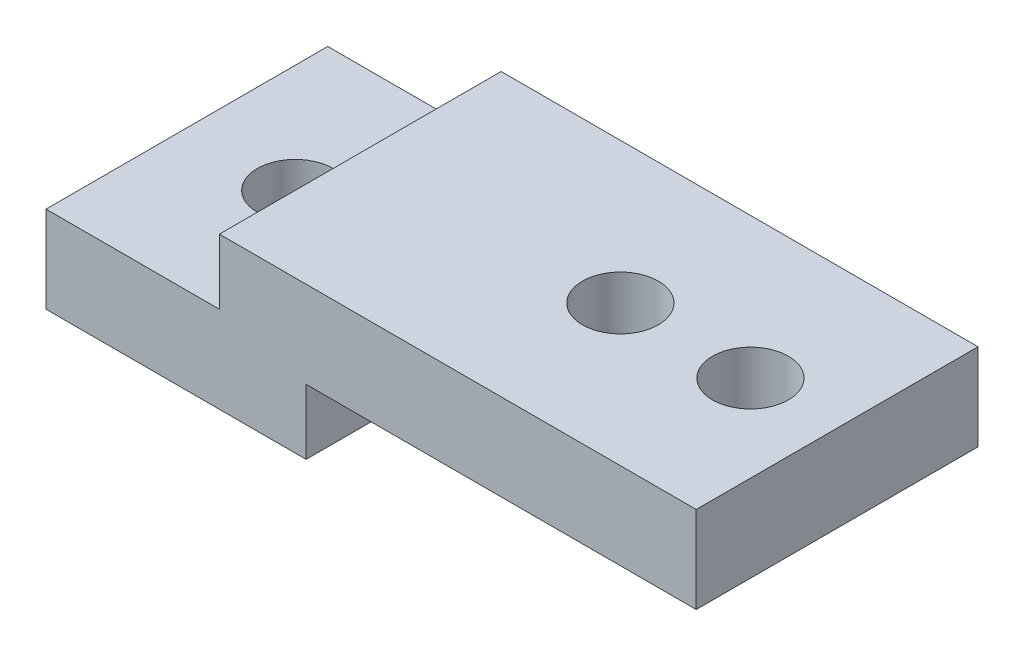
ISO-10303-21;
HEADER;
FILE_DESCRIPTION(('STEP AP214'),'2;1');
FILE_NAME('part.step','',(''),(''),'','','');
FILE_SCHEMA(('AUTOMOTIVE_DESIGN { 1 0 10303 214 1 1 1 1 }'));
ENDSEC;
DATA;
#1=APPLICATION_CONTEXT('core data for automotive mechanical design processes');
#2=APPLICATION_PROTOCOL_DEFINITION('international standard','automotive_design',2000,#1);
#3=PRODUCT_CONTEXT('',#1,'mechanical');
#4=PRODUCT('Part','Part','',(#3));
#5=PRODUCT_RELATED_PRODUCT_CATEGORY('part','',(#4));
#6=PRODUCT_DEFINITION_FORMATION('','',#4);
#7=PRODUCT_DEFINITION_CONTEXT('part definition',#1,'design');
#8=PRODUCT_DEFINITION('design','',#6,#7);
#9=PRODUCT_DEFINITION_SHAPE('','',#8);
#10=(LENGTH_UNIT() NAMED_UNIT(*) SI_UNIT(.MILLI.,.METRE.));
#11=(NAMED_UNIT(*) PLANE_ANGLE_UNIT() SI_UNIT($,.RADIAN.));
#12=(NAMED_UNIT(*) SI_UNIT($,.STERADIAN.) SOLID_ANGLE_UNIT());
#13=UNCERTAINTY_MEASURE_WITH_UNIT(LENGTH_MEASURE(1.E-05),#10,'distance_accuracy_value','');
#14=(GEOMETRIC_REPRESENTATION_CONTEXT(3) GLOBAL_UNCERTAINTY_ASSIGNED_CONTEXT((#13)) GLOBAL_UNIT_ASSIGNED_CONTEXT((#10,
#11,#12)) REPRESENTATION_CONTEXT('',''));
#15=CARTESIAN_POINT('',(0.,0.,0.));
#16=DIRECTION('',(0.,0.,1.));
#17=DIRECTION('',(1.,0.,0.));
#18=AXIS2_PLACEMENT_3D('',#15,#16,#17);
#19=CARTESIAN_POINT('',(0.,4.,-13.));
#20=DIRECTION('',(1.,0.,0.));
#21=DIRECTION('',(0.,0.,-1.));
#22=AXIS2_PLACEMENT_3D('',#19,#20,#21);
#23=PLANE('',#22);
#24=DIRECTION('',(0.,0.,1.));
#25=VECTOR('',#24,1.);
#26=CARTESIAN_POINT('',(0.,0.,-13.));
#27=LINE('',#26,#25);
#28=CARTESIAN_POINT('',(0.,0.,-13.));
#29=VERTEX_POINT('',#28);
#30=CARTESIAN_POINT('',(0.,0.,0.));
#31=VERTEX_POINT('',#30);
#32=EDGE_CURVE('E146',#29,#31,#27,.T.);
#33=ORIENTED_EDGE('',*,*,#32,.T.);
#34=DIRECTION('',(0.,-1.,0.));
#35=VECTOR('',#34,1.);
#36=CARTESIAN_POINT('',(0.,4.,0.));
#37=LINE('',#36,#35);
#38=CARTESIAN_POINT('',(0.,4.,0.));
#39=VERTEX_POINT('',#38);
#40=EDGE_CURVE('E11',#39,#31,#37,.T.);
#41=ORIENTED_EDGE('',*,*,#40,.F.);
#42=DIRECTION('',(0.,0.,1.));
#43=VECTOR('',#42,1.);
#44=CARTESIAN_POINT('',(0.,4.,-13.));
#45=LINE('',#44,#43);
#46=CARTESIAN_POINT('',(0.,4.,-13.));
#47=VERTEX_POINT('',#46);
#48=EDGE_CURVE('E150',#47,#39,#45,.T.);
#49=ORIENTED_EDGE('',*,*,#48,.F.);
#50=DIRECTION('',(0.,-1.,0.));
#51=VECTOR('',#50,1.);
#52=CARTESIAN_POINT('',(0.,4.,-13.));
#53=LINE('',#52,#51);
#54=EDGE_CURVE('E107',#47,#29,#53,.T.);
#55=ORIENTED_EDGE('',*,*,#54,.T.);
#56=EDGE_LOOP('',(#33,#41,#49,#55));
#57=FACE_BOUND('',#56,.T.);
#58=ADVANCED_FACE('F33',(#57),#23,.F.);
#59=CARTESIAN_POINT('',(0.,4.,0.));
#60=DIRECTION('',(0.,0.,-1.));
#61=DIRECTION('',(-1.,0.,0.));
#62=AXIS2_PLACEMENT_3D('',#59,#60,#61);
#63=PLANE('',#62);
#64=DIRECTION('',(1.,0.,0.));
#65=VECTOR('',#64,1.);
#66=CARTESIAN_POINT('',(0.,0.,0.));
#67=LINE('',#66,#65);
#68=CARTESIAN_POINT('',(12.,0.,0.));
#69=VERTEX_POINT('',#68);
#70=EDGE_CURVE('E160',#31,#69,#67,.T.);
#71=ORIENTED_EDGE('',*,*,#70,.T.);
#72=DIRECTION('',(0.,-1.,0.));
#73=VECTOR('',#72,1.);
#74=CARTESIAN_POINT('',(12.,0.,0.));
#75=LINE('',#74,#73);
#76=CARTESIAN_POINT('',(12.,3.,0.));
#77=VERTEX_POINT('',#76);
#78=EDGE_CURVE('E55',#77,#69,#75,.T.);
#79=ORIENTED_EDGE('',*,*,#78,.F.);
#80=DIRECTION('',(-1.,0.,0.));
#81=VECTOR('',#80,1.);
#82=CARTESIAN_POINT('',(30.,3.,0.));
#83=LINE('',#82,#81);
#84=CARTESIAN_POINT('',(30.,3.,0.));
#85=VERTEX_POINT('',#84);
#86=EDGE_CURVE('E135',#85,#77,#83,.T.);
#87=ORIENTED_EDGE('',*,*,#86,.F.);
#88=DIRECTION('',(0.,-1.,0.));
#89=VECTOR('',#88,1.);
#90=CARTESIAN_POINT('',(30.,4.,0.));
#91=LINE('',#90,#89);
#92=CARTESIAN_POINT('',(30.,7.,0.));
#93=VERTEX_POINT('',#92);
#94=EDGE_CURVE('E40',#93,#85,#91,.T.);
#95=ORIENTED_EDGE('',*,*,#94,.F.);
#96=DIRECTION('',(1.,0.,0.));
#97=VECTOR('',#96,1.);
#98=CARTESIAN_POINT('',(30.,7.,0.));
#99=LINE('',#98,#97);
#100=CARTESIAN_POINT('',(8.,7.,0.));
#101=VERTEX_POINT('',#100);
#102=EDGE_CURVE('E121',#101,#93,#99,.T.);
#103=ORIENTED_EDGE('',*,*,#102,.F.);
#104=DIRECTION('',(0.,-1.,0.));
#105=VECTOR('',#104,1.);
#106=CARTESIAN_POINT('',(8.,7.,0.));
#107=LINE('',#106,#105);
#108=CARTESIAN_POINT('',(8.,4.,0.));
#109=VERTEX_POINT('',#108);
#110=EDGE_CURVE('E130',#101,#109,#107,.T.);
#111=ORIENTED_EDGE('',*,*,#110,.T.);
#112=DIRECTION('',(1.,0.,0.));
#113=VECTOR('',#112,1.);
#114=CARTESIAN_POINT('',(0.,4.,0.));
#115=LINE('',#114,#113);
#116=EDGE_CURVE('E153',#39,#109,#115,.T.);
#117=ORIENTED_EDGE('',*,*,#116,.F.);
#118=ORIENTED_EDGE('',*,*,#40,.T.);
#119=EDGE_LOOP('',(#71,#79,#87,#95,#103,#111,#117,#118));
#120=FACE_BOUND('',#119,.T.);
#121=ADVANCED_FACE('F167',(#120),#63,.F.);
#122=CARTESIAN_POINT('',(30.,4.,-13.));
#123=DIRECTION('',(-1.,0.,0.));
#124=DIRECTION('',(0.,0.,1.));
#125=AXIS2_PLACEMENT_3D('',#122,#123,#124);
#126=PLANE('',#125);
#127=ORIENTED_EDGE('',*,*,#94,.T.);
#128=DIRECTION('',(0.,0.,1.));
#129=VECTOR('',#128,1.);
#130=CARTESIAN_POINT('',(30.,3.,-13.));
#131=LINE('',#130,#129);
#132=CARTESIAN_POINT('',(30.,3.,-13.));
#133=VERTEX_POINT('',#132);
#134=EDGE_CURVE('E104',#133,#85,#131,.T.);
#135=ORIENTED_EDGE('',*,*,#134,.F.);
#136=DIRECTION('',(0.,-1.,0.));
#137=VECTOR('',#136,1.);
#138=CARTESIAN_POINT('',(30.,4.,-13.));
#139=LINE('',#138,#137);
#140=CARTESIAN_POINT('',(30.,7.,-13.));
#141=VERTEX_POINT('',#140);
#142=EDGE_CURVE('E98',#141,#133,#139,.T.);
#143=ORIENTED_EDGE('',*,*,#142,.F.);
#144=DIRECTION('',(0.,0.,-1.));
#145=VECTOR('',#144,1.);
#146=CARTESIAN_POINT('',(30.,7.,0.));
#147=LINE('',#146,#145);
#148=EDGE_CURVE('E103',#93,#141,#147,.T.);
#149=ORIENTED_EDGE('',*,*,#148,.F.);
#150=EDGE_LOOP('',(#127,#135,#143,#149));
#151=FACE_BOUND('',#150,.T.);
#152=ADVANCED_FACE('F101',(#151),#126,.F.);
#153=CARTESIAN_POINT('',(0.,4.,-13.));
#154=DIRECTION('',(0.,0.,1.));
#155=DIRECTION('',(1.,0.,0.));
#156=AXIS2_PLACEMENT_3D('',#153,#154,#155);
#157=PLANE('',#156);
#158=DIRECTION('',(-1.,0.,0.));
#159=VECTOR('',#158,1.);
#160=CARTESIAN_POINT('',(30.,3.,-13.));
#161=LINE('',#160,#159);
#162=CARTESIAN_POINT('',(12.,3.,-13.));
#163=VERTEX_POINT('',#162);
#164=EDGE_CURVE('E136',#133,#163,#161,.T.);
#165=ORIENTED_EDGE('',*,*,#164,.T.);
#166=DIRECTION('',(0.,-1.,0.));
#167=VECTOR('',#166,1.);
#168=CARTESIAN_POINT('',(12.,0.,-13.));
#169=LINE('',#168,#167);
#170=CARTESIAN_POINT('',(12.,0.,-13.));
#171=VERTEX_POINT('',#170);
#172=EDGE_CURVE('E138',#163,#171,#169,.T.);
#173=ORIENTED_EDGE('',*,*,#172,.T.);
#174=DIRECTION('',(-1.,0.,0.));
#175=VECTOR('',#174,1.);
#176=CARTESIAN_POINT('',(0.,0.,-13.));
#177=LINE('',#176,#175);
#178=EDGE_CURVE('E154',#171,#29,#177,.T.);
#179=ORIENTED_EDGE('',*,*,#178,.T.);
#180=ORIENTED_EDGE('',*,*,#54,.F.);
#181=DIRECTION('',(-1.,0.,0.));
#182=VECTOR('',#181,1.);
#183=CARTESIAN_POINT('',(0.,4.,-13.));
#184=LINE('',#183,#182);
#185=CARTESIAN_POINT('',(8.,4.,-13.));
#186=VERTEX_POINT('',#185);
#187=EDGE_CURVE('E156',#186,#47,#184,.T.);
#188=ORIENTED_EDGE('',*,*,#187,.F.);
#189=DIRECTION('',(0.,-1.,0.));
#190=VECTOR('',#189,1.);
#191=CARTESIAN_POINT('',(8.,7.,-13.));
#192=LINE('',#191,#190);
#193=CARTESIAN_POINT('',(8.,7.,-13.));
#194=VERTEX_POINT('',#193);
#195=EDGE_CURVE('E113',#194,#186,#192,.T.);
#196=ORIENTED_EDGE('',*,*,#195,.F.);
#197=DIRECTION('',(-1.,0.,0.));
#198=VECTOR('',#197,1.);
#199=CARTESIAN_POINT('',(30.,7.,-13.));
#200=LINE('',#199,#198);
#201=EDGE_CURVE('E110',#141,#194,#200,.T.);
#202=ORIENTED_EDGE('',*,*,#201,.F.);
#203=ORIENTED_EDGE('',*,*,#142,.T.);
#204=EDGE_LOOP('',(#165,#173,#179,#180,#188,#196,#202,#203));
#205=FACE_BOUND('',#204,.T.);
#206=ADVANCED_FACE('F111',(#205),#157,.F.);
#207=CARTESIAN_POINT('',(0.,4.,0.));
#208=DIRECTION('',(0.,1.,0.));
#209=DIRECTION('',(0.,0.,1.));
#210=AXIS2_PLACEMENT_3D('',#207,#208,#209);
#211=PLANE('',#210);
#212=CARTESIAN_POINT('',(5.,4.,-6.5));
#213=DIRECTION('',(0.,1.,0.));
#214=DIRECTION('',(0.,0.,1.));
#215=AXIS2_PLACEMENT_3D('',#212,#213,#214);
#216=CIRCLE('',#215,1.75);
#217=CARTESIAN_POINT('',(5.,4.,-4.75));
#218=VERTEX_POINT('',#217);
#219=EDGE_CURVE('E126',#218,#218,#216,.T.);
#220=ORIENTED_EDGE('',*,*,#219,.F.);
#221=EDGE_LOOP('',(#220));
#222=FACE_BOUND('',#221,.T.);
#223=DIRECTION('',(0.,0.,1.));
#224=VECTOR('',#223,1.);
#225=CARTESIAN_POINT('',(8.,4.,0.));
#226=LINE('',#225,#224);
#227=EDGE_CURVE('E47',#186,#109,#226,.T.);
#228=ORIENTED_EDGE('',*,*,#227,.F.);
#229=ORIENTED_EDGE('',*,*,#187,.T.);
#230=ORIENTED_EDGE('',*,*,#48,.T.);
#231=ORIENTED_EDGE('',*,*,#116,.T.);
#232=EDGE_LOOP('',(#228,#229,#230,#231));
#233=FACE_BOUND('',#232,.T.);
#234=ADVANCED_FACE('F182',(#222,#233),#211,.T.);
#235=CARTESIAN_POINT('',(0.,0.,0.));
#236=DIRECTION('',(0.,1.,0.));
#237=DIRECTION('',(0.,0.,1.));
#238=AXIS2_PLACEMENT_3D('',#235,#236,#237);
#239=PLANE('',#238);
#240=CARTESIAN_POINT('',(5.,0.,-6.5));
#241=DIRECTION('',(0.,1.,0.));
#242=DIRECTION('',(0.,0.,1.));
#243=AXIS2_PLACEMENT_3D('',#240,#241,#242);
#244=CIRCLE('',#243,1.75);
#245=CARTESIAN_POINT('',(5.,0.,-4.75));
#246=VERTEX_POINT('',#245);
#247=EDGE_CURVE('E123',#246,#246,#244,.T.);
#248=ORIENTED_EDGE('',*,*,#247,.T.);
#249=EDGE_LOOP('',(#248));
#250=FACE_BOUND('',#249,.T.);
#251=ORIENTED_EDGE('',*,*,#178,.F.);
#252=DIRECTION('',(0.,0.,1.));
#253=VECTOR('',#252,1.);
#254=CARTESIAN_POINT('',(12.,0.,-13.));
#255=LINE('',#254,#253);
#256=EDGE_CURVE('E144',#171,#69,#255,.T.);
#257=ORIENTED_EDGE('',*,*,#256,.T.);
#258=ORIENTED_EDGE('',*,*,#70,.F.);
#259=ORIENTED_EDGE('',*,*,#32,.F.);
#260=EDGE_LOOP('',(#251,#257,#258,#259));
#261=FACE_BOUND('',#260,.T.);
#262=ADVANCED_FACE('F175',(#250,#261),#239,.F.);
#263=CARTESIAN_POINT('',(12.,0.,-13.));
#264=DIRECTION('',(-1.,0.,0.));
#265=DIRECTION('',(0.,0.,1.));
#266=AXIS2_PLACEMENT_3D('',#263,#264,#265);
#267=PLANE('',#266);
#268=ORIENTED_EDGE('',*,*,#78,.T.);
#269=ORIENTED_EDGE('',*,*,#256,.F.);
#270=ORIENTED_EDGE('',*,*,#172,.F.);
#271=DIRECTION('',(0.,0.,1.));
#272=VECTOR('',#271,1.);
#273=CARTESIAN_POINT('',(12.,3.,-13.));
#274=LINE('',#273,#272);
#275=EDGE_CURVE('E147',#163,#77,#274,.T.);
#276=ORIENTED_EDGE('',*,*,#275,.T.);
#277=EDGE_LOOP('',(#268,#269,#270,#276));
#278=FACE_BOUND('',#277,.T.);
#279=ADVANCED_FACE('F190',(#278),#267,.F.);
#280=CARTESIAN_POINT('',(30.,3.,-13.));
#281=DIRECTION('',(0.,1.,0.));
#282=DIRECTION('',(-1.,0.,0.));
#283=AXIS2_PLACEMENT_3D('',#280,#281,#282);
#284=PLANE('',#283);
#285=CARTESIAN_POINT('',(26.,3.,-6.5));
#286=DIRECTION('',(0.,1.,0.));
#287=DIRECTION('',(-1.,0.,0.));
#288=AXIS2_PLACEMENT_3D('',#285,#286,#287);
#289=CIRCLE('',#288,1.75);
#290=CARTESIAN_POINT('',(24.25,3.,-6.5));
#291=VERTEX_POINT('',#290);
#292=EDGE_CURVE('E312',#291,#291,#289,.T.);
#293=ORIENTED_EDGE('',*,*,#292,.T.);
#294=EDGE_LOOP('',(#293));
#295=FACE_BOUND('',#294,.T.);
#296=CARTESIAN_POINT('',(20.,3.,-6.5));
#297=DIRECTION('',(0.,1.,0.));
#298=DIRECTION('',(-1.,0.,0.));
#299=AXIS2_PLACEMENT_3D('',#296,#297,#298);
#300=CIRCLE('',#299,1.75);
#301=CARTESIAN_POINT('',(18.25,3.,-6.5));
#302=VERTEX_POINT('',#301);
#303=EDGE_CURVE('E316',#302,#302,#300,.T.);
#304=ORIENTED_EDGE('',*,*,#303,.T.);
#305=EDGE_LOOP('',(#304));
#306=FACE_BOUND('',#305,.T.);
#307=ORIENTED_EDGE('',*,*,#86,.T.);
#308=ORIENTED_EDGE('',*,*,#275,.F.);
#309=ORIENTED_EDGE('',*,*,#164,.F.);
#310=ORIENTED_EDGE('',*,*,#134,.T.);
#311=EDGE_LOOP('',(#307,#308,#309,#310));
#312=FACE_BOUND('',#311,.T.);
#313=ADVANCED_FACE('F169',(#295,#306,#312),#284,.F.);
#314=CARTESIAN_POINT('',(8.,7.,0.));
#315=DIRECTION('',(1.,0.,0.));
#316=DIRECTION('',(0.,0.,-1.));
#317=AXIS2_PLACEMENT_3D('',#314,#315,#316);
#318=PLANE('',#317);
#319=ORIENTED_EDGE('',*,*,#227,.T.);
#320=ORIENTED_EDGE('',*,*,#110,.F.);
#321=DIRECTION('',(0.,0.,1.));
#322=VECTOR('',#321,1.);
#323=CARTESIAN_POINT('',(8.,7.,0.));
#324=LINE('',#323,#322);
#325=EDGE_CURVE('E116',#194,#101,#324,.T.);
#326=ORIENTED_EDGE('',*,*,#325,.F.);
#327=ORIENTED_EDGE('',*,*,#195,.T.);
#328=EDGE_LOOP('',(#319,#320,#326,#327));
#329=FACE_BOUND('',#328,.T.);
#330=ADVANCED_FACE('F180',(#329),#318,.F.);
#331=CARTESIAN_POINT('',(0.,7.,0.));
#332=DIRECTION('',(0.,1.,0.));
#333=DIRECTION('',(0.,0.,1.));
#334=AXIS2_PLACEMENT_3D('',#331,#332,#333);
#335=PLANE('',#334);
#336=CARTESIAN_POINT('',(26.,7.,-6.5));
#337=DIRECTION('',(0.,1.,0.));
#338=DIRECTION('',(0.,0.,1.));
#339=AXIS2_PLACEMENT_3D('',#336,#337,#338);
#340=CIRCLE('',#339,1.75);
#341=CARTESIAN_POINT('',(26.,7.,-4.75));
#342=VERTEX_POINT('',#341);
#343=EDGE_CURVE('E309',#342,#342,#340,.T.);
#344=ORIENTED_EDGE('',*,*,#343,.F.);
#345=EDGE_LOOP('',(#344));
#346=FACE_BOUND('',#345,.T.);
#347=CARTESIAN_POINT('',(20.,7.,-6.5));
#348=DIRECTION('',(0.,1.,0.));
#349=DIRECTION('',(0.,0.,1.));
#350=AXIS2_PLACEMENT_3D('',#347,#348,#349);
#351=CIRCLE('',#350,1.75);
#352=CARTESIAN_POINT('',(20.,7.,-4.75));
#353=VERTEX_POINT('',#352);
#354=EDGE_CURVE('E313',#353,#353,#351,.T.);
#355=ORIENTED_EDGE('',*,*,#354,.F.);
#356=EDGE_LOOP('',(#355));
#357=FACE_BOUND('',#356,.T.);
#358=ORIENTED_EDGE('',*,*,#148,.T.);
#359=ORIENTED_EDGE('',*,*,#201,.T.);
#360=ORIENTED_EDGE('',*,*,#325,.T.);
#361=ORIENTED_EDGE('',*,*,#102,.T.);
#362=EDGE_LOOP('',(#358,#359,#360,#361));
#363=FACE_BOUND('',#362,.T.);
#364=ADVANCED_FACE('F119',(#346,#357,#363),#335,.T.);
#365=CARTESIAN_POINT('',(5.,0.,-6.5));
#366=DIRECTION('',(0.,1.,0.));
#367=DIRECTION('',(0.,0.,1.));
#368=AXIS2_PLACEMENT_3D('',#365,#366,#367);
#369=CYLINDRICAL_SURFACE('',#368,1.75);
#370=ORIENTED_EDGE('',*,*,#247,.F.);
#371=EDGE_LOOP('',(#370));
#372=FACE_BOUND('',#371,.T.);
#373=ORIENTED_EDGE('',*,*,#219,.T.);
#374=EDGE_LOOP('',(#373));
#375=FACE_BOUND('',#374,.T.);
#376=ADVANCED_FACE('F239',(#372,#375),#369,.F.);
#377=CARTESIAN_POINT('',(20.,0.,-6.5));
#378=DIRECTION('',(0.,1.,0.));
#379=DIRECTION('',(0.,0.,1.));
#380=AXIS2_PLACEMENT_3D('',#377,#378,#379);
#381=CYLINDRICAL_SURFACE('',#380,1.75);
#382=ORIENTED_EDGE('',*,*,#354,.T.);
#383=EDGE_LOOP('',(#382));
#384=FACE_BOUND('',#383,.T.);
#385=ORIENTED_EDGE('',*,*,#303,.F.);
#386=EDGE_LOOP('',(#385));
#387=FACE_BOUND('',#386,.T.);
#388=ADVANCED_FACE('F244',(#384,#387),#381,.F.);
#389=CARTESIAN_POINT('',(26.,0.,-6.5));
#390=DIRECTION('',(0.,1.,0.));
#391=DIRECTION('',(0.,0.,1.));
#392=AXIS2_PLACEMENT_3D('',#389,#390,#391);
#393=CYLINDRICAL_SURFACE('',#392,1.75);
#394=ORIENTED_EDGE('',*,*,#343,.T.);
#395=EDGE_LOOP('',(#394));
#396=FACE_BOUND('',#395,.T.);
#397=ORIENTED_EDGE('',*,*,#292,.F.);
#398=EDGE_LOOP('',(#397));
#399=FACE_BOUND('',#398,.T.);
#400=ADVANCED_FACE('F269',(#396,#399),#393,.F.);
#401=CLOSED_SHELL('',(#58,#121,#152,#206,#234,#262,#279,#313,#330,#364,#376,#388,#400));
#402=MANIFOLD_SOLID_BREP('B2',#401);
#403=ADVANCED_BREP_SHAPE_REPRESENTATION('',(#18,#402),#14);
#404=SHAPE_DEFINITION_REPRESENTATION(#9,#403);
ENDSEC;
END-ISO-10303-21;
